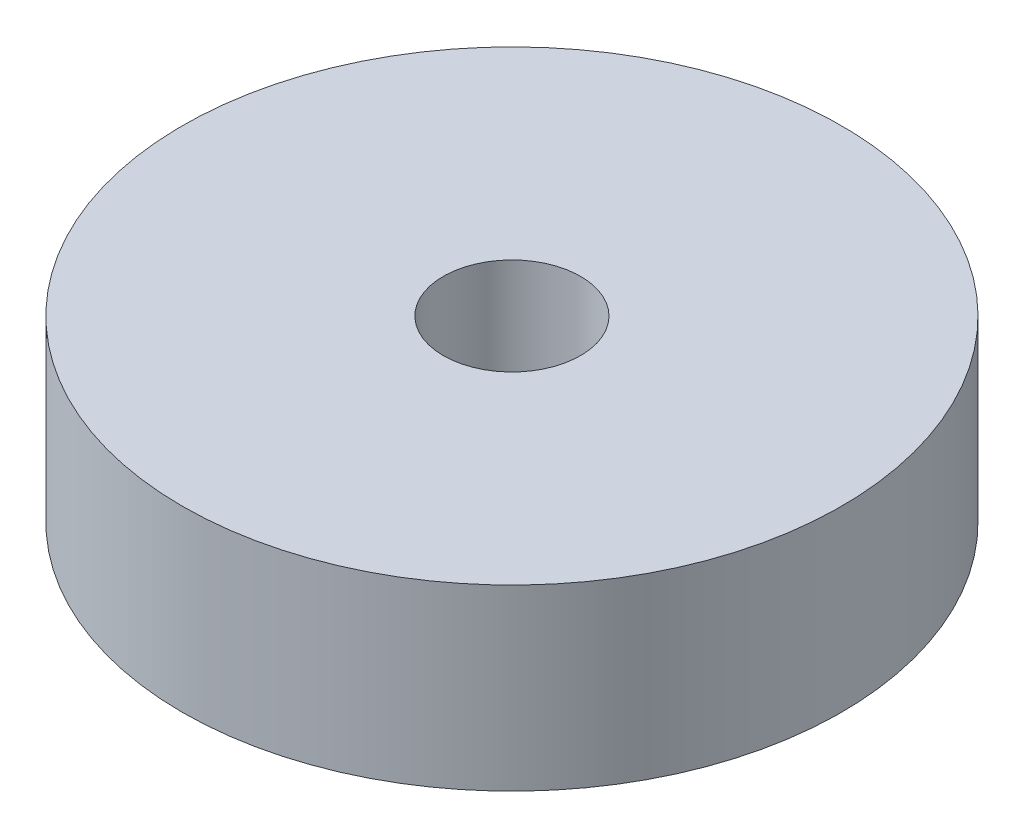
ISO-10303-21;
HEADER;
FILE_DESCRIPTION(('STEP AP214'),'2;1');
FILE_NAME('part.step','',(''),(''),'','','');
FILE_SCHEMA(('AUTOMOTIVE_DESIGN { 1 0 10303 214 1 1 1 1 }'));
ENDSEC;
DATA;
#1=APPLICATION_CONTEXT('core data for automotive mechanical design processes');
#2=APPLICATION_PROTOCOL_DEFINITION('international standard','automotive_design',2000,#1);
#3=PRODUCT_CONTEXT('',#1,'mechanical');
#4=PRODUCT('Part','Part','',(#3));
#5=PRODUCT_RELATED_PRODUCT_CATEGORY('part','',(#4));
#6=PRODUCT_DEFINITION_FORMATION('','',#4);
#7=PRODUCT_DEFINITION_CONTEXT('part definition',#1,'design');
#8=PRODUCT_DEFINITION('design','',#6,#7);
#9=PRODUCT_DEFINITION_SHAPE('','',#8);
#10=(LENGTH_UNIT() NAMED_UNIT(*) SI_UNIT(.MILLI.,.METRE.));
#11=(NAMED_UNIT(*) PLANE_ANGLE_UNIT() SI_UNIT($,.RADIAN.));
#12=(NAMED_UNIT(*) SI_UNIT($,.STERADIAN.) SOLID_ANGLE_UNIT());
#13=UNCERTAINTY_MEASURE_WITH_UNIT(LENGTH_MEASURE(1.E-05),#10,'distance_accuracy_value','');
#14=(GEOMETRIC_REPRESENTATION_CONTEXT(3) GLOBAL_UNCERTAINTY_ASSIGNED_CONTEXT((#13)) GLOBAL_UNIT_ASSIGNED_CONTEXT((#10,
#11,#12)) REPRESENTATION_CONTEXT('',''));
#15=CARTESIAN_POINT('',(0.,0.,0.));
#16=DIRECTION('',(0.,0.,1.));
#17=DIRECTION('',(1.,0.,0.));
#18=AXIS2_PLACEMENT_3D('',#15,#16,#17);
#19=CARTESIAN_POINT('',(0.,13.,0.));
#20=DIRECTION('',(0.,-1.,0.));
#21=DIRECTION('',(0.,0.,-1.));
#22=AXIS2_PLACEMENT_3D('',#19,#20,#21);
#23=CYLINDRICAL_SURFACE('',#22,24.);
#24=CARTESIAN_POINT('',(0.,13.,0.));
#25=DIRECTION('',(0.,1.,0.));
#26=DIRECTION('',(0.,0.,1.));
#27=AXIS2_PLACEMENT_3D('',#24,#25,#26);
#28=CIRCLE('',#27,24.);
#29=CARTESIAN_POINT('',(0.,13.,24.));
#30=VERTEX_POINT('',#29);
#31=EDGE_CURVE('E10',#30,#30,#28,.T.);
#32=ORIENTED_EDGE('',*,*,#31,.F.);
#33=EDGE_LOOP('',(#32));
#34=FACE_BOUND('',#33,.T.);
#35=CARTESIAN_POINT('',(0.,0.,0.));
#36=DIRECTION('',(0.,1.,0.));
#37=DIRECTION('',(0.,0.,1.));
#38=AXIS2_PLACEMENT_3D('',#35,#36,#37);
#39=CIRCLE('',#38,24.);
#40=CARTESIAN_POINT('',(0.,0.,24.));
#41=VERTEX_POINT('',#40);
#42=EDGE_CURVE('E38',#41,#41,#39,.T.);
#43=ORIENTED_EDGE('',*,*,#42,.T.);
#44=EDGE_LOOP('',(#43));
#45=FACE_BOUND('',#44,.T.);
#46=ADVANCED_FACE('F35',(#34,#45),#23,.T.);
#47=CARTESIAN_POINT('',(0.,13.,0.));
#48=DIRECTION('',(0.,1.,0.));
#49=DIRECTION('',(0.,0.,1.));
#50=AXIS2_PLACEMENT_3D('',#47,#48,#49);
#51=PLANE('',#50);
#52=CARTESIAN_POINT('',(0.,13.,0.));
#53=DIRECTION('',(0.,1.,0.));
#54=DIRECTION('',(0.,0.,1.));
#55=AXIS2_PLACEMENT_3D('',#52,#53,#54);
#56=CIRCLE('',#55,5.);
#57=CARTESIAN_POINT('',(0.,13.,5.));
#58=VERTEX_POINT('',#57);
#59=EDGE_CURVE('E47',#58,#58,#56,.T.);
#60=ORIENTED_EDGE('',*,*,#59,.F.);
#61=EDGE_LOOP('',(#60));
#62=FACE_BOUND('',#61,.T.);
#63=ORIENTED_EDGE('',*,*,#31,.T.);
#64=EDGE_LOOP('',(#63));
#65=FACE_BOUND('',#64,.T.);
#66=ADVANCED_FACE('F83',(#62,#65),#51,.T.);
#67=CARTESIAN_POINT('',(0.,0.,0.));
#68=DIRECTION('',(0.,1.,0.));
#69=DIRECTION('',(0.,0.,1.));
#70=AXIS2_PLACEMENT_3D('',#67,#68,#69);
#71=PLANE('',#70);
#72=CARTESIAN_POINT('',(11.,0.,11.));
#73=DIRECTION('',(0.,-1.,0.));
#74=DIRECTION('',(0.,0.,-1.));
#75=AXIS2_PLACEMENT_3D('',#72,#73,#74);
#76=CIRCLE('',#75,1.5);
#77=CARTESIAN_POINT('',(11.,0.,9.5));
#78=VERTEX_POINT('',#77);
#79=EDGE_CURVE('E56',#78,#78,#76,.T.);
#80=ORIENTED_EDGE('',*,*,#79,.F.);
#81=EDGE_LOOP('',(#80));
#82=FACE_BOUND('',#81,.T.);
#83=CARTESIAN_POINT('',(-11.,0.,-11.));
#84=DIRECTION('',(0.,-1.,0.));
#85=DIRECTION('',(0.,0.,-1.));
#86=AXIS2_PLACEMENT_3D('',#83,#84,#85);
#87=CIRCLE('',#86,1.5);
#88=CARTESIAN_POINT('',(-11.,0.,-12.5));
#89=VERTEX_POINT('',#88);
#90=EDGE_CURVE('E62',#89,#89,#87,.T.);
#91=ORIENTED_EDGE('',*,*,#90,.F.);
#92=EDGE_LOOP('',(#91));
#93=FACE_BOUND('',#92,.T.);
#94=CARTESIAN_POINT('',(11.,0.,-11.));
#95=DIRECTION('',(0.,-1.,0.));
#96=DIRECTION('',(0.,0.,-1.));
#97=AXIS2_PLACEMENT_3D('',#94,#95,#96);
#98=CIRCLE('',#97,1.5);
#99=CARTESIAN_POINT('',(11.,0.,-12.5));
#100=VERTEX_POINT('',#99);
#101=EDGE_CURVE('E63',#100,#100,#98,.T.);
#102=ORIENTED_EDGE('',*,*,#101,.F.);
#103=EDGE_LOOP('',(#102));
#104=FACE_BOUND('',#103,.T.);
#105=CARTESIAN_POINT('',(-11.,0.,11.));
#106=DIRECTION('',(0.,-1.,0.));
#107=DIRECTION('',(0.,0.,-1.));
#108=AXIS2_PLACEMENT_3D('',#105,#106,#107);
#109=CIRCLE('',#108,1.5);
#110=CARTESIAN_POINT('',(-11.,0.,9.5));
#111=VERTEX_POINT('',#110);
#112=EDGE_CURVE('E53',#111,#111,#109,.T.);
#113=ORIENTED_EDGE('',*,*,#112,.F.);
#114=EDGE_LOOP('',(#113));
#115=FACE_BOUND('',#114,.T.);
#116=ORIENTED_EDGE('',*,*,#42,.F.);
#117=EDGE_LOOP('',(#116));
#118=FACE_BOUND('',#117,.T.);
#119=ADVANCED_FACE('F79',(#82,#93,#104,#115,#118),#71,.F.);
#120=CARTESIAN_POINT('',(0.,3.,0.));
#121=DIRECTION('',(0.,1.,0.));
#122=DIRECTION('',(0.,0.,1.));
#123=AXIS2_PLACEMENT_3D('',#120,#121,#122);
#124=CYLINDRICAL_SURFACE('',#123,5.);
#125=CARTESIAN_POINT('',(0.,3.,0.));
#126=DIRECTION('',(0.,1.,0.));
#127=DIRECTION('',(0.,0.,1.));
#128=AXIS2_PLACEMENT_3D('',#125,#126,#127);
#129=CIRCLE('',#128,5.);
#130=CARTESIAN_POINT('',(0.,3.,5.));
#131=VERTEX_POINT('',#130);
#132=EDGE_CURVE('E45',#131,#131,#129,.T.);
#133=ORIENTED_EDGE('',*,*,#132,.F.);
#134=EDGE_LOOP('',(#133));
#135=FACE_BOUND('',#134,.T.);
#136=ORIENTED_EDGE('',*,*,#59,.T.);
#137=EDGE_LOOP('',(#136));
#138=FACE_BOUND('',#137,.T.);
#139=ADVANCED_FACE('F82',(#135,#138),#124,.F.);
#140=CARTESIAN_POINT('',(0.,3.,0.));
#141=DIRECTION('',(0.,1.,0.));
#142=DIRECTION('',(0.,0.,1.));
#143=AXIS2_PLACEMENT_3D('',#140,#141,#142);
#144=PLANE('',#143);
#145=ORIENTED_EDGE('',*,*,#132,.T.);
#146=EDGE_LOOP('',(#145));
#147=FACE_BOUND('',#146,.T.);
#148=ADVANCED_FACE('F103',(#147),#144,.T.);
#149=CARTESIAN_POINT('',(-11.,8.,11.));
#150=DIRECTION('',(0.,-1.,0.));
#151=DIRECTION('',(0.,0.,-1.));
#152=AXIS2_PLACEMENT_3D('',#149,#150,#151);
#153=CYLINDRICAL_SURFACE('',#152,1.5);
#154=CARTESIAN_POINT('',(-11.,8.,11.));
#155=DIRECTION('',(0.,-1.,0.));
#156=DIRECTION('',(0.,0.,-1.));
#157=AXIS2_PLACEMENT_3D('',#154,#155,#156);
#158=CIRCLE('',#157,1.5);
#159=CARTESIAN_POINT('',(-11.,8.,9.5));
#160=VERTEX_POINT('',#159);
#161=EDGE_CURVE('E50',#160,#160,#158,.T.);
#162=ORIENTED_EDGE('',*,*,#161,.F.);
#163=EDGE_LOOP('',(#162));
#164=FACE_BOUND('',#163,.T.);
#165=ORIENTED_EDGE('',*,*,#112,.T.);
#166=EDGE_LOOP('',(#165));
#167=FACE_BOUND('',#166,.T.);
#168=ADVANCED_FACE('F107',(#164,#167),#153,.F.);
#169=CARTESIAN_POINT('',(0.,8.,0.));
#170=DIRECTION('',(0.,-1.,0.));
#171=DIRECTION('',(0.,0.,-1.));
#172=AXIS2_PLACEMENT_3D('',#169,#170,#171);
#173=PLANE('',#172);
#174=ORIENTED_EDGE('',*,*,#161,.T.);
#175=EDGE_LOOP('',(#174));
#176=FACE_BOUND('',#175,.T.);
#177=ADVANCED_FACE('F111',(#176),#173,.T.);
#178=CARTESIAN_POINT('',(11.,8.,-11.));
#179=DIRECTION('',(0.,-1.,0.));
#180=DIRECTION('',(0.,0.,-1.));
#181=AXIS2_PLACEMENT_3D('',#178,#179,#180);
#182=CYLINDRICAL_SURFACE('',#181,1.5);
#183=CARTESIAN_POINT('',(11.,8.,-11.));
#184=DIRECTION('',(0.,-1.,0.));
#185=DIRECTION('',(0.,0.,-1.));
#186=AXIS2_PLACEMENT_3D('',#183,#184,#185);
#187=CIRCLE('',#186,1.5);
#188=CARTESIAN_POINT('',(11.,8.,-12.5));
#189=VERTEX_POINT('',#188);
#190=EDGE_CURVE('E71',#189,#189,#187,.T.);
#191=ORIENTED_EDGE('',*,*,#190,.F.);
#192=EDGE_LOOP('',(#191));
#193=FACE_BOUND('',#192,.T.);
#194=ORIENTED_EDGE('',*,*,#101,.T.);
#195=EDGE_LOOP('',(#194));
#196=FACE_BOUND('',#195,.T.);
#197=ADVANCED_FACE('F77',(#193,#196),#182,.F.);
#198=CARTESIAN_POINT('',(11.,8.,-11.));
#199=DIRECTION('',(0.,-1.,0.));
#200=DIRECTION('',(0.,0.,-1.));
#201=AXIS2_PLACEMENT_3D('',#198,#199,#200);
#202=PLANE('',#201);
#203=ORIENTED_EDGE('',*,*,#190,.T.);
#204=EDGE_LOOP('',(#203));
#205=FACE_BOUND('',#204,.T.);
#206=ADVANCED_FACE('F124',(#205),#202,.T.);
#207=CARTESIAN_POINT('',(-11.,8.,-11.));
#208=DIRECTION('',(0.,-1.,0.));
#209=DIRECTION('',(0.,0.,-1.));
#210=AXIS2_PLACEMENT_3D('',#207,#208,#209);
#211=CYLINDRICAL_SURFACE('',#210,1.5);
#212=CARTESIAN_POINT('',(-11.,8.,-11.));
#213=DIRECTION('',(0.,-1.,0.));
#214=DIRECTION('',(0.,0.,-1.));
#215=AXIS2_PLACEMENT_3D('',#212,#213,#214);
#216=CIRCLE('',#215,1.5);
#217=CARTESIAN_POINT('',(-11.,8.,-12.5));
#218=VERTEX_POINT('',#217);
#219=EDGE_CURVE('E59',#218,#218,#216,.T.);
#220=ORIENTED_EDGE('',*,*,#219,.F.);
#221=EDGE_LOOP('',(#220));
#222=FACE_BOUND('',#221,.T.);
#223=ORIENTED_EDGE('',*,*,#90,.T.);
#224=EDGE_LOOP('',(#223));
#225=FACE_BOUND('',#224,.T.);
#226=ADVANCED_FACE('F120',(#222,#225),#211,.F.);
#227=CARTESIAN_POINT('',(-11.,8.,-11.));
#228=DIRECTION('',(0.,-1.,0.));
#229=DIRECTION('',(0.,0.,-1.));
#230=AXIS2_PLACEMENT_3D('',#227,#228,#229);
#231=PLANE('',#230);
#232=ORIENTED_EDGE('',*,*,#219,.T.);
#233=EDGE_LOOP('',(#232));
#234=FACE_BOUND('',#233,.T.);
#235=ADVANCED_FACE('F116',(#234),#231,.T.);
#236=CARTESIAN_POINT('',(11.,8.,11.));
#237=DIRECTION('',(0.,-1.,0.));
#238=DIRECTION('',(0.,0.,-1.));
#239=AXIS2_PLACEMENT_3D('',#236,#237,#238);
#240=CYLINDRICAL_SURFACE('',#239,1.5);
#241=CARTESIAN_POINT('',(11.,8.,11.));
#242=DIRECTION('',(0.,-1.,0.));
#243=DIRECTION('',(0.,0.,-1.));
#244=AXIS2_PLACEMENT_3D('',#241,#242,#243);
#245=CIRCLE('',#244,1.5);
#246=CARTESIAN_POINT('',(11.,8.,9.5));
#247=VERTEX_POINT('',#246);
#248=EDGE_CURVE('E66',#247,#247,#245,.T.);
#249=ORIENTED_EDGE('',*,*,#248,.F.);
#250=EDGE_LOOP('',(#249));
#251=FACE_BOUND('',#250,.T.);
#252=ORIENTED_EDGE('',*,*,#79,.T.);
#253=EDGE_LOOP('',(#252));
#254=FACE_BOUND('',#253,.T.);
#255=ADVANCED_FACE('F119',(#251,#254),#240,.F.);
#256=CARTESIAN_POINT('',(0.,8.,0.));
#257=DIRECTION('',(0.,-1.,0.));
#258=DIRECTION('',(0.,0.,-1.));
#259=AXIS2_PLACEMENT_3D('',#256,#257,#258);
#260=PLANE('',#259);
#261=ORIENTED_EDGE('',*,*,#248,.T.);
#262=EDGE_LOOP('',(#261));
#263=FACE_BOUND('',#262,.T.);
#264=ADVANCED_FACE('F126',(#263),#260,.T.);
#265=CLOSED_SHELL('',(#46,#66,#119,#139,#148,#168,#177,#197,#206,#226,#235,#255,#264));
#266=MANIFOLD_SOLID_BREP('B2',#265);
#267=ADVANCED_BREP_SHAPE_REPRESENTATION('',(#18,#266),#14);
#268=SHAPE_DEFINITION_REPRESENTATION(#9,#267);
ENDSEC;
END-ISO-10303-21;
